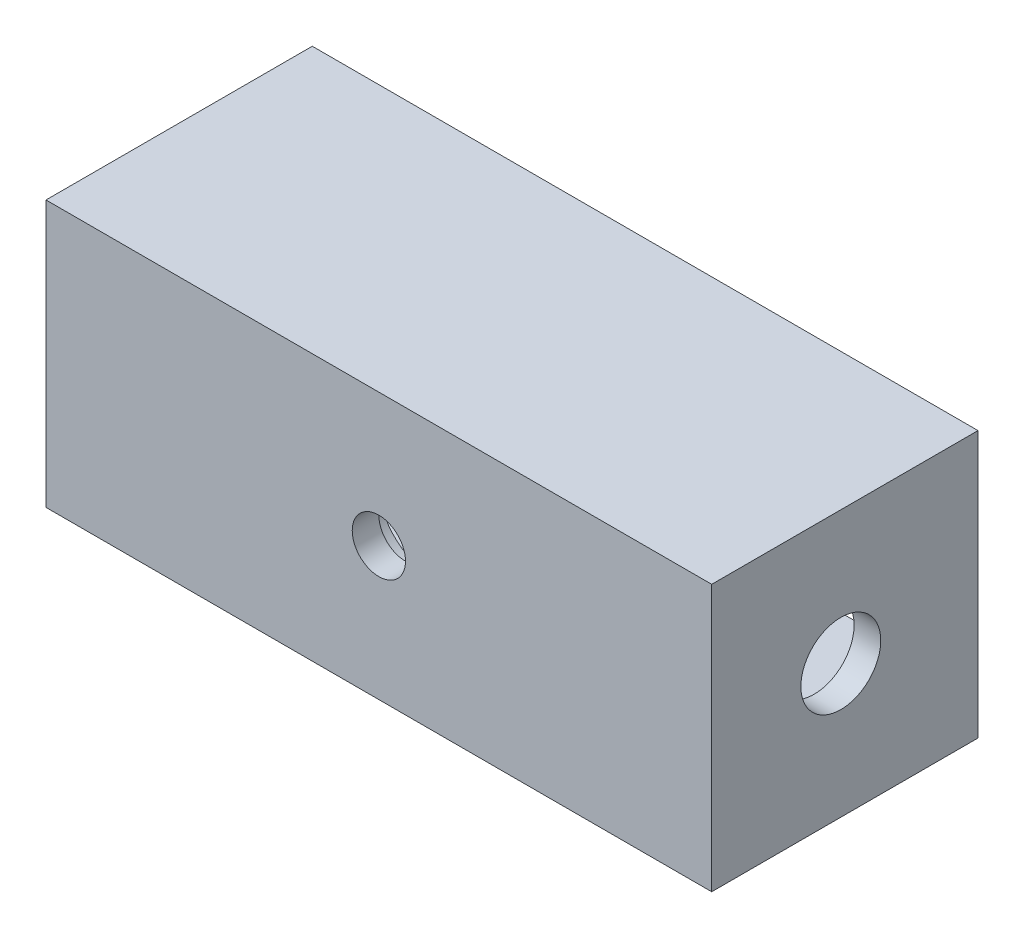
ISO-10303-21;
HEADER;
FILE_DESCRIPTION(('STEP AP214'),'2;1');
FILE_NAME('part.step','',(''),(''),'','','');
FILE_SCHEMA(('AUTOMOTIVE_DESIGN { 1 0 10303 214 1 1 1 1 }'));
ENDSEC;
DATA;
#1=APPLICATION_CONTEXT('core data for automotive mechanical design processes');
#2=APPLICATION_PROTOCOL_DEFINITION('international standard','automotive_design',2000,#1);
#3=PRODUCT_CONTEXT('',#1,'mechanical');
#4=PRODUCT('Part','Part','',(#3));
#5=PRODUCT_RELATED_PRODUCT_CATEGORY('part','',(#4));
#6=PRODUCT_DEFINITION_FORMATION('','',#4);
#7=PRODUCT_DEFINITION_CONTEXT('part definition',#1,'design');
#8=PRODUCT_DEFINITION('design','',#6,#7);
#9=PRODUCT_DEFINITION_SHAPE('','',#8);
#10=(LENGTH_UNIT() NAMED_UNIT(*) SI_UNIT(.MILLI.,.METRE.));
#11=(NAMED_UNIT(*) PLANE_ANGLE_UNIT() SI_UNIT($,.RADIAN.));
#12=(NAMED_UNIT(*) SI_UNIT($,.STERADIAN.) SOLID_ANGLE_UNIT());
#13=UNCERTAINTY_MEASURE_WITH_UNIT(LENGTH_MEASURE(1.E-05),#10,'distance_accuracy_value','');
#14=(GEOMETRIC_REPRESENTATION_CONTEXT(3) GLOBAL_UNCERTAINTY_ASSIGNED_CONTEXT((#13)) GLOBAL_UNIT_ASSIGNED_CONTEXT((#10,
#11,#12)) REPRESENTATION_CONTEXT('',''));
#15=CARTESIAN_POINT('',(0.,0.,0.));
#16=DIRECTION('',(0.,0.,1.));
#17=DIRECTION('',(1.,0.,0.));
#18=AXIS2_PLACEMENT_3D('',#15,#16,#17);
#19=CARTESIAN_POINT('',(12.5,5.,10.));
#20=DIRECTION('',(-1.,0.,0.));
#21=DIRECTION('',(0.,-1.,0.));
#22=AXIS2_PLACEMENT_3D('',#19,#20,#21);
#23=PLANE('',#22);
#24=CARTESIAN_POINT('',(12.5,0.,5.1522071946124));
#25=DIRECTION('',(1.,0.,0.));
#26=DIRECTION('',(0.,1.,0.));
#27=AXIS2_PLACEMENT_3D('',#24,#25,#26);
#28=CIRCLE('',#27,1.5);
#29=CARTESIAN_POINT('',(12.5,1.5,5.1522071946124));
#30=VERTEX_POINT('',#29);
#31=EDGE_CURVE('E199',#30,#30,#28,.T.);
#32=ORIENTED_EDGE('',*,*,#31,.F.);
#33=EDGE_LOOP('',(#32));
#34=FACE_BOUND('',#33,.T.);
#35=DIRECTION('',(0.,1.,0.));
#36=VECTOR('',#35,1.);
#37=CARTESIAN_POINT('',(12.5,5.,0.));
#38=LINE('',#37,#36);
#39=CARTESIAN_POINT('',(12.5,-5.,0.));
#40=VERTEX_POINT('',#39);
#41=CARTESIAN_POINT('',(12.5,5.,0.));
#42=VERTEX_POINT('',#41);
#43=EDGE_CURVE('E145',#40,#42,#38,.T.);
#44=ORIENTED_EDGE('',*,*,#43,.T.);
#45=DIRECTION('',(0.,0.,-1.));
#46=VECTOR('',#45,1.);
#47=CARTESIAN_POINT('',(12.5,5.,10.));
#48=LINE('',#47,#46);
#49=CARTESIAN_POINT('',(12.5,5.,10.));
#50=VERTEX_POINT('',#49);
#51=EDGE_CURVE('E11',#50,#42,#48,.T.);
#52=ORIENTED_EDGE('',*,*,#51,.F.);
#53=DIRECTION('',(0.,1.,0.));
#54=VECTOR('',#53,1.);
#55=CARTESIAN_POINT('',(12.5,5.,10.));
#56=LINE('',#55,#54);
#57=CARTESIAN_POINT('',(12.5,-5.,10.));
#58=VERTEX_POINT('',#57);
#59=EDGE_CURVE('E149',#58,#50,#56,.T.);
#60=ORIENTED_EDGE('',*,*,#59,.F.);
#61=DIRECTION('',(0.,0.,-1.));
#62=VECTOR('',#61,1.);
#63=CARTESIAN_POINT('',(12.5,-5.,10.));
#64=LINE('',#63,#62);
#65=EDGE_CURVE('E155',#58,#40,#64,.T.);
#66=ORIENTED_EDGE('',*,*,#65,.T.);
#67=EDGE_LOOP('',(#44,#52,#60,#66));
#68=FACE_BOUND('',#67,.T.);
#69=ADVANCED_FACE('F33',(#34,#68),#23,.F.);
#70=CARTESIAN_POINT('',(-12.5,5.,10.));
#71=DIRECTION('',(0.,-1.,0.));
#72=DIRECTION('',(0.,0.,-1.));
#73=AXIS2_PLACEMENT_3D('',#70,#71,#72);
#74=PLANE('',#73);
#75=DIRECTION('',(-1.,0.,0.));
#76=VECTOR('',#75,1.);
#77=CARTESIAN_POINT('',(-12.5,5.,0.));
#78=LINE('',#77,#76);
#79=CARTESIAN_POINT('',(-12.5,5.,0.));
#80=VERTEX_POINT('',#79);
#81=EDGE_CURVE('E158',#42,#80,#78,.T.);
#82=ORIENTED_EDGE('',*,*,#81,.T.);
#83=DIRECTION('',(0.,0.,-1.));
#84=VECTOR('',#83,1.);
#85=CARTESIAN_POINT('',(-12.5,5.,10.));
#86=LINE('',#85,#84);
#87=CARTESIAN_POINT('',(-12.5,5.,10.));
#88=VERTEX_POINT('',#87);
#89=EDGE_CURVE('E41',#88,#80,#86,.T.);
#90=ORIENTED_EDGE('',*,*,#89,.F.);
#91=DIRECTION('',(-1.,0.,0.));
#92=VECTOR('',#91,1.);
#93=CARTESIAN_POINT('',(-12.5,5.,10.));
#94=LINE('',#93,#92);
#95=EDGE_CURVE('E85',#50,#88,#94,.T.);
#96=ORIENTED_EDGE('',*,*,#95,.F.);
#97=ORIENTED_EDGE('',*,*,#51,.T.);
#98=EDGE_LOOP('',(#82,#90,#96,#97));
#99=FACE_BOUND('',#98,.T.);
#100=ADVANCED_FACE('F188',(#99),#74,.F.);
#101=CARTESIAN_POINT('',(-12.5,5.,10.));
#102=DIRECTION('',(1.,0.,0.));
#103=DIRECTION('',(0.,1.,0.));
#104=AXIS2_PLACEMENT_3D('',#101,#102,#103);
#105=PLANE('',#104);
#106=CARTESIAN_POINT('',(-12.5,0.,5.1522071946124));
#107=DIRECTION('',(1.,0.,0.));
#108=DIRECTION('',(0.,1.,0.));
#109=AXIS2_PLACEMENT_3D('',#106,#107,#108);
#110=CIRCLE('',#109,1.5);
#111=CARTESIAN_POINT('',(-12.5,1.5,5.1522071946124));
#112=VERTEX_POINT('',#111);
#113=EDGE_CURVE('E133',#112,#112,#110,.T.);
#114=ORIENTED_EDGE('',*,*,#113,.T.);
#115=EDGE_LOOP('',(#114));
#116=FACE_BOUND('',#115,.T.);
#117=DIRECTION('',(0.,-1.,0.));
#118=VECTOR('',#117,1.);
#119=CARTESIAN_POINT('',(-12.5,5.,0.));
#120=LINE('',#119,#118);
#121=CARTESIAN_POINT('',(-12.5,-5.,0.));
#122=VERTEX_POINT('',#121);
#123=EDGE_CURVE('E160',#80,#122,#120,.T.);
#124=ORIENTED_EDGE('',*,*,#123,.T.);
#125=DIRECTION('',(0.,0.,-1.));
#126=VECTOR('',#125,1.);
#127=CARTESIAN_POINT('',(-12.5,-5.,10.));
#128=LINE('',#127,#126);
#129=CARTESIAN_POINT('',(-12.5,-5.,10.));
#130=VERTEX_POINT('',#129);
#131=EDGE_CURVE('E164',#130,#122,#128,.T.);
#132=ORIENTED_EDGE('',*,*,#131,.F.);
#133=DIRECTION('',(0.,-1.,0.));
#134=VECTOR('',#133,1.);
#135=CARTESIAN_POINT('',(-12.5,5.,10.));
#136=LINE('',#135,#134);
#137=EDGE_CURVE('E152',#88,#130,#136,.T.);
#138=ORIENTED_EDGE('',*,*,#137,.F.);
#139=ORIENTED_EDGE('',*,*,#89,.T.);
#140=EDGE_LOOP('',(#124,#132,#138,#139));
#141=FACE_BOUND('',#140,.T.);
#142=ADVANCED_FACE('F170',(#116,#141),#105,.F.);
#143=CARTESIAN_POINT('',(-12.5,-5.,10.));
#144=DIRECTION('',(0.,1.,0.));
#145=DIRECTION('',(0.,0.,1.));
#146=AXIS2_PLACEMENT_3D('',#143,#144,#145);
#147=PLANE('',#146);
#148=DIRECTION('',(1.,0.,0.));
#149=VECTOR('',#148,1.);
#150=CARTESIAN_POINT('',(-12.5,-5.,0.));
#151=LINE('',#150,#149);
#152=EDGE_CURVE('E78',#122,#40,#151,.T.);
#153=ORIENTED_EDGE('',*,*,#152,.T.);
#154=ORIENTED_EDGE('',*,*,#65,.F.);
#155=DIRECTION('',(1.,0.,0.));
#156=VECTOR('',#155,1.);
#157=CARTESIAN_POINT('',(-12.5,-5.,10.));
#158=LINE('',#157,#156);
#159=EDGE_CURVE('E57',#130,#58,#158,.T.);
#160=ORIENTED_EDGE('',*,*,#159,.F.);
#161=ORIENTED_EDGE('',*,*,#131,.T.);
#162=EDGE_LOOP('',(#153,#154,#160,#161));
#163=FACE_BOUND('',#162,.T.);
#164=ADVANCED_FACE('F178',(#163),#147,.F.);
#165=CARTESIAN_POINT('',(0.,0.,10.));
#166=DIRECTION('',(0.,0.,1.));
#167=DIRECTION('',(1.,0.,0.));
#168=AXIS2_PLACEMENT_3D('',#165,#166,#167);
#169=PLANE('',#168);
#170=CARTESIAN_POINT('',(0.,0.,10.));
#171=DIRECTION('',(0.,0.,1.));
#172=DIRECTION('',(1.,0.,0.));
#173=AXIS2_PLACEMENT_3D('',#170,#171,#172);
#174=CIRCLE('',#173,1.);
#175=CARTESIAN_POINT('',(1.,0.,10.));
#176=VERTEX_POINT('',#175);
#177=EDGE_CURVE('E313',#176,#176,#174,.T.);
#178=ORIENTED_EDGE('',*,*,#177,.F.);
#179=EDGE_LOOP('',(#178));
#180=FACE_BOUND('',#179,.T.);
#181=ORIENTED_EDGE('',*,*,#59,.T.);
#182=ORIENTED_EDGE('',*,*,#95,.T.);
#183=ORIENTED_EDGE('',*,*,#137,.T.);
#184=ORIENTED_EDGE('',*,*,#159,.T.);
#185=EDGE_LOOP('',(#181,#182,#183,#184));
#186=FACE_BOUND('',#185,.T.);
#187=ADVANCED_FACE('F180',(#180,#186),#169,.T.);
#188=CARTESIAN_POINT('',(0.,0.,0.));
#189=DIRECTION('',(0.,0.,1.));
#190=DIRECTION('',(1.,0.,0.));
#191=AXIS2_PLACEMENT_3D('',#188,#189,#190);
#192=PLANE('',#191);
#193=DIRECTION('',(1.,0.,0.));
#194=VECTOR('',#193,1.);
#195=CARTESIAN_POINT('',(11.5,3.5,0.));
#196=LINE('',#195,#194);
#197=CARTESIAN_POINT('',(-11.5,3.5,0.));
#198=VERTEX_POINT('',#197);
#199=CARTESIAN_POINT('',(11.5,3.5,0.));
#200=VERTEX_POINT('',#199);
#201=EDGE_CURVE('E139',#198,#200,#196,.T.);
#202=ORIENTED_EDGE('',*,*,#201,.F.);
#203=DIRECTION('',(0.,1.,0.));
#204=VECTOR('',#203,1.);
#205=CARTESIAN_POINT('',(-11.5,3.5,0.));
#206=LINE('',#205,#204);
#207=CARTESIAN_POINT('',(-11.5,-3.5,0.));
#208=VERTEX_POINT('',#207);
#209=EDGE_CURVE('E48',#208,#198,#206,.T.);
#210=ORIENTED_EDGE('',*,*,#209,.F.);
#211=DIRECTION('',(-1.,0.,0.));
#212=VECTOR('',#211,1.);
#213=CARTESIAN_POINT('',(11.5,-3.5,0.));
#214=LINE('',#213,#212);
#215=CARTESIAN_POINT('',(11.5,-3.5,0.));
#216=VERTEX_POINT('',#215);
#217=EDGE_CURVE('E127',#216,#208,#214,.T.);
#218=ORIENTED_EDGE('',*,*,#217,.F.);
#219=DIRECTION('',(0.,-1.,0.));
#220=VECTOR('',#219,1.);
#221=CARTESIAN_POINT('',(11.5,3.5,0.));
#222=LINE('',#221,#220);
#223=EDGE_CURVE('E130',#200,#216,#222,.T.);
#224=ORIENTED_EDGE('',*,*,#223,.F.);
#225=EDGE_LOOP('',(#202,#210,#218,#224));
#226=FACE_BOUND('',#225,.T.);
#227=ORIENTED_EDGE('',*,*,#43,.F.);
#228=ORIENTED_EDGE('',*,*,#152,.F.);
#229=ORIENTED_EDGE('',*,*,#123,.F.);
#230=ORIENTED_EDGE('',*,*,#81,.F.);
#231=EDGE_LOOP('',(#227,#228,#229,#230));
#232=FACE_BOUND('',#231,.T.);
#233=ADVANCED_FACE('F174',(#226,#232),#192,.F.);
#234=CARTESIAN_POINT('',(-11.5,3.5,8.));
#235=DIRECTION('',(-1.,0.,0.));
#236=DIRECTION('',(0.,0.,1.));
#237=AXIS2_PLACEMENT_3D('',#234,#235,#236);
#238=PLANE('',#237);
#239=CARTESIAN_POINT('',(-11.5,0.,5.1522071946124));
#240=DIRECTION('',(-1.,0.,0.));
#241=DIRECTION('',(0.,0.,1.));
#242=AXIS2_PLACEMENT_3D('',#239,#240,#241);
#243=CIRCLE('',#242,1.5);
#244=CARTESIAN_POINT('',(-11.5,0.,6.6522071946124));
#245=VERTEX_POINT('',#244);
#246=EDGE_CURVE('E204',#245,#245,#243,.T.);
#247=ORIENTED_EDGE('',*,*,#246,.T.);
#248=EDGE_LOOP('',(#247));
#249=FACE_BOUND('',#248,.T.);
#250=ORIENTED_EDGE('',*,*,#209,.T.);
#251=DIRECTION('',(0.,0.,-1.));
#252=VECTOR('',#251,1.);
#253=CARTESIAN_POINT('',(-11.5,3.5,8.));
#254=LINE('',#253,#252);
#255=CARTESIAN_POINT('',(-11.5,3.5,8.));
#256=VERTEX_POINT('',#255);
#257=EDGE_CURVE('E105',#256,#198,#254,.T.);
#258=ORIENTED_EDGE('',*,*,#257,.F.);
#259=DIRECTION('',(0.,1.,0.));
#260=VECTOR('',#259,1.);
#261=CARTESIAN_POINT('',(-11.5,3.5,8.));
#262=LINE('',#261,#260);
#263=CARTESIAN_POINT('',(-11.5,-3.5,8.));
#264=VERTEX_POINT('',#263);
#265=EDGE_CURVE('E109',#264,#256,#262,.T.);
#266=ORIENTED_EDGE('',*,*,#265,.F.);
#267=DIRECTION('',(0.,0.,-1.));
#268=VECTOR('',#267,1.);
#269=CARTESIAN_POINT('',(-11.5,-3.5,8.));
#270=LINE('',#269,#268);
#271=EDGE_CURVE('E143',#264,#208,#270,.T.);
#272=ORIENTED_EDGE('',*,*,#271,.T.);
#273=EDGE_LOOP('',(#250,#258,#266,#272));
#274=FACE_BOUND('',#273,.T.);
#275=ADVANCED_FACE('F107',(#249,#274),#238,.F.);
#276=CARTESIAN_POINT('',(11.5,-3.5,8.));
#277=DIRECTION('',(0.,-1.,0.));
#278=DIRECTION('',(0.,0.,-1.));
#279=AXIS2_PLACEMENT_3D('',#276,#277,#278);
#280=PLANE('',#279);
#281=ORIENTED_EDGE('',*,*,#217,.T.);
#282=ORIENTED_EDGE('',*,*,#271,.F.);
#283=DIRECTION('',(-1.,0.,0.));
#284=VECTOR('',#283,1.);
#285=CARTESIAN_POINT('',(11.5,-3.5,8.));
#286=LINE('',#285,#284);
#287=CARTESIAN_POINT('',(11.5,-3.5,8.));
#288=VERTEX_POINT('',#287);
#289=EDGE_CURVE('E115',#288,#264,#286,.T.);
#290=ORIENTED_EDGE('',*,*,#289,.F.);
#291=DIRECTION('',(0.,0.,-1.));
#292=VECTOR('',#291,1.);
#293=CARTESIAN_POINT('',(11.5,-3.5,8.));
#294=LINE('',#293,#292);
#295=EDGE_CURVE('E146',#288,#216,#294,.T.);
#296=ORIENTED_EDGE('',*,*,#295,.T.);
#297=EDGE_LOOP('',(#281,#282,#290,#296));
#298=FACE_BOUND('',#297,.T.);
#299=ADVANCED_FACE('F233',(#298),#280,.F.);
#300=CARTESIAN_POINT('',(11.5,3.5,8.));
#301=DIRECTION('',(1.,0.,0.));
#302=DIRECTION('',(0.,0.,-1.));
#303=AXIS2_PLACEMENT_3D('',#300,#301,#302);
#304=PLANE('',#303);
#305=CARTESIAN_POINT('',(11.5,0.,5.1522071946124));
#306=DIRECTION('',(1.,0.,0.));
#307=DIRECTION('',(0.,0.,-1.));
#308=AXIS2_PLACEMENT_3D('',#305,#306,#307);
#309=CIRCLE('',#308,1.5);
#310=CARTESIAN_POINT('',(11.5,0.,3.6522071946124));
#311=VERTEX_POINT('',#310);
#312=EDGE_CURVE('E36',#311,#311,#309,.T.);
#313=ORIENTED_EDGE('',*,*,#312,.T.);
#314=EDGE_LOOP('',(#313));
#315=FACE_BOUND('',#314,.T.);
#316=ORIENTED_EDGE('',*,*,#223,.T.);
#317=ORIENTED_EDGE('',*,*,#295,.F.);
#318=DIRECTION('',(0.,-1.,0.));
#319=VECTOR('',#318,1.);
#320=CARTESIAN_POINT('',(11.5,3.5,8.));
#321=LINE('',#320,#319);
#322=CARTESIAN_POINT('',(11.5,3.5,8.));
#323=VERTEX_POINT('',#322);
#324=EDGE_CURVE('E123',#323,#288,#321,.T.);
#325=ORIENTED_EDGE('',*,*,#324,.F.);
#326=DIRECTION('',(0.,0.,-1.));
#327=VECTOR('',#326,1.);
#328=CARTESIAN_POINT('',(11.5,3.5,8.));
#329=LINE('',#328,#327);
#330=EDGE_CURVE('E114',#323,#200,#329,.T.);
#331=ORIENTED_EDGE('',*,*,#330,.T.);
#332=EDGE_LOOP('',(#316,#317,#325,#331));
#333=FACE_BOUND('',#332,.T.);
#334=ADVANCED_FACE('F236',(#315,#333),#304,.F.);
#335=CARTESIAN_POINT('',(11.5,3.5,8.));
#336=DIRECTION('',(0.,1.,0.));
#337=DIRECTION('',(0.,0.,1.));
#338=AXIS2_PLACEMENT_3D('',#335,#336,#337);
#339=PLANE('',#338);
#340=ORIENTED_EDGE('',*,*,#201,.T.);
#341=ORIENTED_EDGE('',*,*,#330,.F.);
#342=DIRECTION('',(1.,0.,0.));
#343=VECTOR('',#342,1.);
#344=CARTESIAN_POINT('',(11.5,3.5,8.));
#345=LINE('',#344,#343);
#346=EDGE_CURVE('E118',#256,#323,#345,.T.);
#347=ORIENTED_EDGE('',*,*,#346,.F.);
#348=ORIENTED_EDGE('',*,*,#257,.T.);
#349=EDGE_LOOP('',(#340,#341,#347,#348));
#350=FACE_BOUND('',#349,.T.);
#351=ADVANCED_FACE('F119',(#350),#339,.F.);
#352=CARTESIAN_POINT('',(0.,0.,8.));
#353=DIRECTION('',(0.,0.,-1.));
#354=DIRECTION('',(-1.,0.,0.));
#355=AXIS2_PLACEMENT_3D('',#352,#353,#354);
#356=PLANE('',#355);
#357=CARTESIAN_POINT('',(0.,0.,8.));
#358=DIRECTION('',(0.,0.,-1.));
#359=DIRECTION('',(-1.,0.,0.));
#360=AXIS2_PLACEMENT_3D('',#357,#358,#359);
#361=CIRCLE('',#360,2.);
#362=CARTESIAN_POINT('',(-2.,0.,8.));
#363=VERTEX_POINT('',#362);
#364=EDGE_CURVE('E206',#363,#363,#361,.T.);
#365=ORIENTED_EDGE('',*,*,#364,.F.);
#366=EDGE_LOOP('',(#365));
#367=FACE_BOUND('',#366,.T.);
#368=ORIENTED_EDGE('',*,*,#265,.T.);
#369=ORIENTED_EDGE('',*,*,#346,.T.);
#370=ORIENTED_EDGE('',*,*,#324,.T.);
#371=ORIENTED_EDGE('',*,*,#289,.T.);
#372=EDGE_LOOP('',(#368,#369,#370,#371));
#373=FACE_BOUND('',#372,.T.);
#374=ADVANCED_FACE('F125',(#367,#373),#356,.T.);
#375=CARTESIAN_POINT('',(-38.5,0.,5.1522071946124));
#376=DIRECTION('',(1.,0.,0.));
#377=DIRECTION('',(0.,1.,0.));
#378=AXIS2_PLACEMENT_3D('',#375,#376,#377);
#379=CYLINDRICAL_SURFACE('',#378,1.5);
#380=ORIENTED_EDGE('',*,*,#31,.T.);
#381=EDGE_LOOP('',(#380));
#382=FACE_BOUND('',#381,.T.);
#383=ORIENTED_EDGE('',*,*,#312,.F.);
#384=EDGE_LOOP('',(#383));
#385=FACE_BOUND('',#384,.T.);
#386=ADVANCED_FACE('F218',(#382,#385),#379,.F.);
#387=ORIENTED_EDGE('',*,*,#246,.F.);
#388=EDGE_LOOP('',(#387));
#389=FACE_BOUND('',#388,.T.);
#390=ORIENTED_EDGE('',*,*,#113,.F.);
#391=EDGE_LOOP('',(#390));
#392=FACE_BOUND('',#391,.T.);
#393=ADVANCED_FACE('F215',(#389,#392),#379,.F.);
#394=CARTESIAN_POINT('',(0.,0.,9.));
#395=DIRECTION('',(0.,0.,-1.));
#396=DIRECTION('',(-1.,0.,0.));
#397=AXIS2_PLACEMENT_3D('',#394,#395,#396);
#398=CYLINDRICAL_SURFACE('',#397,2.);
#399=CARTESIAN_POINT('',(0.,0.,9.));
#400=DIRECTION('',(0.,0.,-1.));
#401=DIRECTION('',(-1.,0.,0.));
#402=AXIS2_PLACEMENT_3D('',#399,#400,#401);
#403=CIRCLE('',#402,2.);
#404=CARTESIAN_POINT('',(-2.,0.,9.));
#405=VERTEX_POINT('',#404);
#406=EDGE_CURVE('E201',#405,#405,#403,.T.);
#407=ORIENTED_EDGE('',*,*,#406,.F.);
#408=EDGE_LOOP('',(#407));
#409=FACE_BOUND('',#408,.T.);
#410=ORIENTED_EDGE('',*,*,#364,.T.);
#411=EDGE_LOOP('',(#410));
#412=FACE_BOUND('',#411,.T.);
#413=ADVANCED_FACE('F217',(#409,#412),#398,.F.);
#414=CARTESIAN_POINT('',(0.,0.,9.));
#415=DIRECTION('',(0.,0.,-1.));
#416=DIRECTION('',(-1.,0.,0.));
#417=AXIS2_PLACEMENT_3D('',#414,#415,#416);
#418=PLANE('',#417);
#419=CARTESIAN_POINT('',(0.,0.,9.));
#420=DIRECTION('',(0.,0.,-1.));
#421=DIRECTION('',(-1.,0.,0.));
#422=AXIS2_PLACEMENT_3D('',#419,#420,#421);
#423=CIRCLE('',#422,1.);
#424=CARTESIAN_POINT('',(-1.,0.,9.));
#425=VERTEX_POINT('',#424);
#426=EDGE_CURVE('E316',#425,#425,#423,.T.);
#427=ORIENTED_EDGE('',*,*,#426,.F.);
#428=EDGE_LOOP('',(#427));
#429=FACE_BOUND('',#428,.T.);
#430=ORIENTED_EDGE('',*,*,#406,.T.);
#431=EDGE_LOOP('',(#430));
#432=FACE_BOUND('',#431,.T.);
#433=ADVANCED_FACE('F225',(#429,#432),#418,.T.);
#434=CARTESIAN_POINT('',(0.,0.,13.));
#435=DIRECTION('',(0.,0.,-1.));
#436=DIRECTION('',(-1.,0.,0.));
#437=AXIS2_PLACEMENT_3D('',#434,#435,#436);
#438=CYLINDRICAL_SURFACE('',#437,1.);
#439=ORIENTED_EDGE('',*,*,#177,.T.);
#440=EDGE_LOOP('',(#439));
#441=FACE_BOUND('',#440,.T.);
#442=ORIENTED_EDGE('',*,*,#426,.T.);
#443=EDGE_LOOP('',(#442));
#444=FACE_BOUND('',#443,.T.);
#445=ADVANCED_FACE('F297',(#441,#444),#438,.F.);
#446=CLOSED_SHELL('',(#69,#100,#142,#164,#187,#233,#275,#299,#334,#351,#374,#386,#393,#413,#433,#445));
#447=MANIFOLD_SOLID_BREP('B2',#446);
#448=ADVANCED_BREP_SHAPE_REPRESENTATION('',(#18,#447),#14);
#449=SHAPE_DEFINITION_REPRESENTATION(#9,#448);
ENDSEC;
END-ISO-10303-21;
